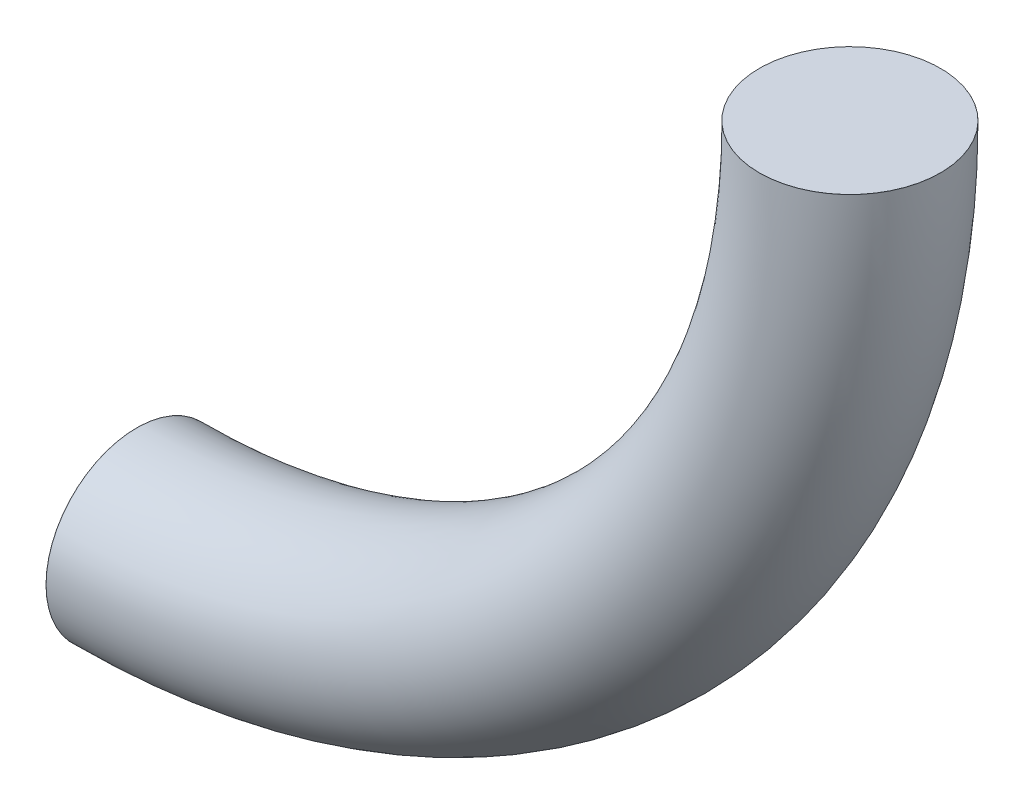
ISO-10303-21;
HEADER;
FILE_DESCRIPTION(('STEP AP214'),'2;1');
FILE_NAME('part.step','',(''),(''),'','','');
FILE_SCHEMA(('AUTOMOTIVE_DESIGN { 1 0 10303 214 1 1 1 1 }'));
ENDSEC;
DATA;
#1=APPLICATION_CONTEXT('core data for automotive mechanical design processes');
#2=APPLICATION_PROTOCOL_DEFINITION('international standard','automotive_design',2000,#1);
#3=PRODUCT_CONTEXT('',#1,'mechanical');
#4=PRODUCT('Part','Part','',(#3));
#5=PRODUCT_RELATED_PRODUCT_CATEGORY('part','',(#4));
#6=PRODUCT_DEFINITION_FORMATION('','',#4);
#7=PRODUCT_DEFINITION_CONTEXT('part definition',#1,'design');
#8=PRODUCT_DEFINITION('design','',#6,#7);
#9=PRODUCT_DEFINITION_SHAPE('','',#8);
#10=(LENGTH_UNIT() NAMED_UNIT(*) SI_UNIT(.MILLI.,.METRE.));
#11=(NAMED_UNIT(*) PLANE_ANGLE_UNIT() SI_UNIT($,.RADIAN.));
#12=(NAMED_UNIT(*) SI_UNIT($,.STERADIAN.) SOLID_ANGLE_UNIT());
#13=UNCERTAINTY_MEASURE_WITH_UNIT(LENGTH_MEASURE(1.E-05),#10,'distance_accuracy_value','');
#14=(GEOMETRIC_REPRESENTATION_CONTEXT(3) GLOBAL_UNCERTAINTY_ASSIGNED_CONTEXT((#13)) GLOBAL_UNIT_ASSIGNED_CONTEXT((#10,
#11,#12)) REPRESENTATION_CONTEXT('',''));
#15=CARTESIAN_POINT('',(0.,0.,0.));
#16=DIRECTION('',(0.,0.,1.));
#17=DIRECTION('',(1.,0.,0.));
#18=AXIS2_PLACEMENT_3D('',#15,#16,#17);
#19=CARTESIAN_POINT('',(-50.0000000000003,-50.01,0.));
#20=DIRECTION('',(-1.,0.,0.));
#21=DIRECTION('',(0.,0.,1.));
#22=AXIS2_PLACEMENT_3D('',#19,#20,#21);
#23=CYLINDRICAL_SURFACE('',#22,6.35);
#24=CARTESIAN_POINT('',(-50.0000000000003,-50.01,0.));
#25=DIRECTION('',(1.,0.,0.));
#26=DIRECTION('',(0.,0.,1.));
#27=AXIS2_PLACEMENT_3D('',#24,#25,#26);
#28=CIRCLE('',#27,6.35);
#29=CARTESIAN_POINT('',(-50.0000000000004,-56.36,0.));
#30=VERTEX_POINT('',#29);
#31=EDGE_CURVE('E36',#30,#30,#28,.T.);
#32=ORIENTED_EDGE('',*,*,#31,.F.);
#33=EDGE_LOOP('',(#32));
#34=FACE_BOUND('',#33,.T.);
#35=CARTESIAN_POINT('',(-50.01,-50.01,0.));
#36=DIRECTION('',(1.,0.,0.));
#37=DIRECTION('',(0.,0.,1.));
#38=AXIS2_PLACEMENT_3D('',#35,#36,#37);
#39=CIRCLE('',#38,6.35);
#40=CARTESIAN_POINT('',(-50.01,-50.01,6.35));
#41=VERTEX_POINT('',#40);
#42=EDGE_CURVE('E10',#41,#41,#39,.T.);
#43=ORIENTED_EDGE('',*,*,#42,.T.);
#44=EDGE_LOOP('',(#43));
#45=FACE_BOUND('',#44,.T.);
#46=ADVANCED_FACE('F30',(#34,#45),#23,.T.);
#47=CARTESIAN_POINT('',(-50.,-0.0100000000000169,0.));
#48=DIRECTION('',(0.,0.,-1.));
#49=DIRECTION('',(-1.,0.,0.));
#50=AXIS2_PLACEMENT_3D('',#47,#48,#49);
#51=TOROIDAL_SURFACE('',#50,50.,6.35);
#52=CARTESIAN_POINT('',(0.,-0.00999999999966306,0.));
#53=DIRECTION('',(0.,1.,0.));
#54=DIRECTION('',(0.,0.,1.));
#55=AXIS2_PLACEMENT_3D('',#52,#53,#54);
#56=CIRCLE('',#55,6.35);
#57=CARTESIAN_POINT('',(6.34999999999999,-0.00999999999961811,0.));
#58=VERTEX_POINT('',#57);
#59=EDGE_CURVE('E40',#58,#58,#56,.T.);
#60=CARTESIAN_POINT('',(-50.,-0.0100000000000169,0.));
#61=DIRECTION('',(0.,0.,-1.));
#62=DIRECTION('',(-1.,0.,0.));
#63=AXIS2_PLACEMENT_3D('',#60,#61,#62);
#64=CIRCLE('',#63,56.35);
#65=EDGE_CURVE('',#58,#30,#64,.T.);
#66=ORIENTED_EDGE('',*,*,#59,.F.);
#67=ORIENTED_EDGE('',*,*,#31,.T.);
#68=ORIENTED_EDGE('',*,*,#65,.T.);
#69=ORIENTED_EDGE('',*,*,#65,.F.);
#70=EDGE_LOOP('',(#66,#68,#67,#69));
#71=FACE_BOUND('',#70,.T.);
#72=ADVANCED_FACE('F55',(#71),#51,.T.);
#73=CARTESIAN_POINT('',(0.,-0.00999999999966306,0.));
#74=DIRECTION('',(0.,1.,0.));
#75=DIRECTION('',(0.,0.,1.));
#76=AXIS2_PLACEMENT_3D('',#73,#74,#75);
#77=CYLINDRICAL_SURFACE('',#76,6.35);
#78=ORIENTED_EDGE('',*,*,#59,.T.);
#79=EDGE_LOOP('',(#78));
#80=FACE_BOUND('',#79,.T.);
#81=CARTESIAN_POINT('',(0.,0.,0.));
#82=DIRECTION('',(0.,1.,0.));
#83=DIRECTION('',(0.,0.,1.));
#84=AXIS2_PLACEMENT_3D('',#81,#82,#83);
#85=CIRCLE('',#84,6.35);
#86=CARTESIAN_POINT('',(0.,0.,6.35));
#87=VERTEX_POINT('',#86);
#88=EDGE_CURVE('E44',#87,#87,#85,.T.);
#89=ORIENTED_EDGE('',*,*,#88,.F.);
#90=EDGE_LOOP('',(#89));
#91=FACE_BOUND('',#90,.T.);
#92=ADVANCED_FACE('F52',(#80,#91),#77,.T.);
#93=CARTESIAN_POINT('',(-50.01,-50.01,0.));
#94=DIRECTION('',(1.,0.,0.));
#95=DIRECTION('',(0.,0.,1.));
#96=AXIS2_PLACEMENT_3D('',#93,#94,#95);
#97=PLANE('',#96);
#98=ORIENTED_EDGE('',*,*,#42,.F.);
#99=EDGE_LOOP('',(#98));
#100=FACE_BOUND('',#99,.T.);
#101=ADVANCED_FACE('F54',(#100),#97,.F.);
#102=CARTESIAN_POINT('',(0.,0.,0.));
#103=DIRECTION('',(0.,1.,0.));
#104=DIRECTION('',(0.,0.,1.));
#105=AXIS2_PLACEMENT_3D('',#102,#103,#104);
#106=PLANE('',#105);
#107=ORIENTED_EDGE('',*,*,#88,.T.);
#108=EDGE_LOOP('',(#107));
#109=FACE_BOUND('',#108,.T.);
#110=ADVANCED_FACE('F50',(#109),#106,.T.);
#111=CLOSED_SHELL('',(#46,#72,#92,#101,#110));
#112=MANIFOLD_SOLID_BREP('B2',#111);
#113=ADVANCED_BREP_SHAPE_REPRESENTATION('',(#18,#112),#14);
#114=SHAPE_DEFINITION_REPRESENTATION(#9,#113);
ENDSEC;
END-ISO-10303-21;
